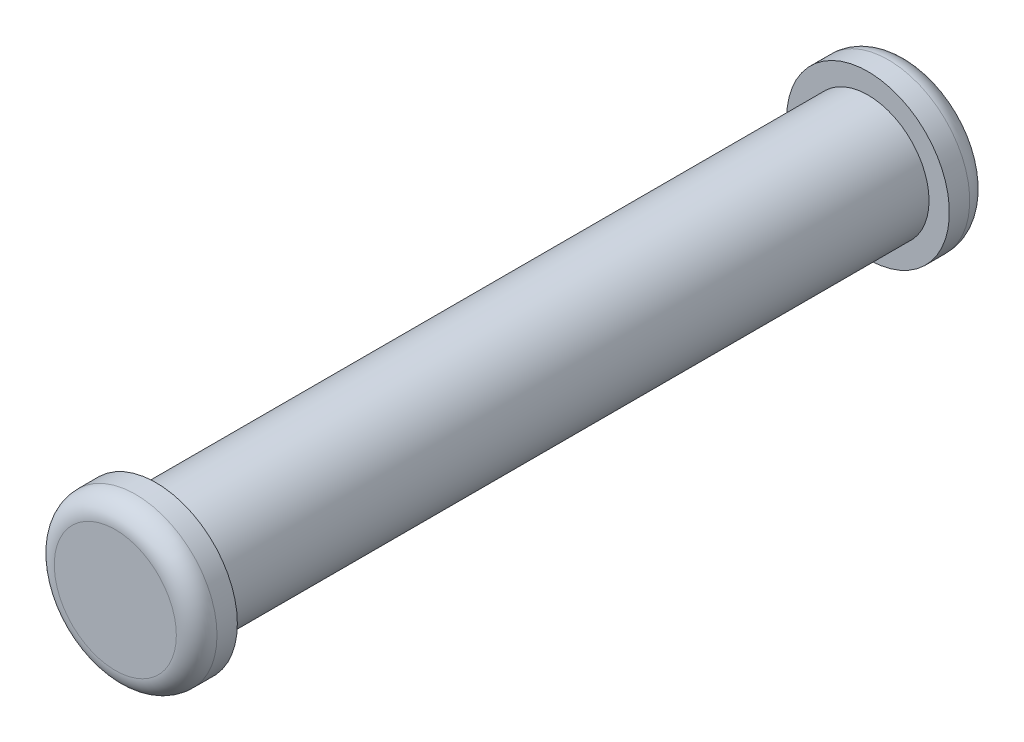
ISO-10303-21;
HEADER;
FILE_DESCRIPTION(('STEP AP214'),'2;1');
FILE_NAME('part.step','',(''),(''),'','','');
FILE_SCHEMA(('AUTOMOTIVE_DESIGN { 1 0 10303 214 1 1 1 1 }'));
ENDSEC;
DATA;
#1=APPLICATION_CONTEXT('core data for automotive mechanical design processes');
#2=APPLICATION_PROTOCOL_DEFINITION('international standard','automotive_design',2000,#1);
#3=PRODUCT_CONTEXT('',#1,'mechanical');
#4=PRODUCT('Part','Part','',(#3));
#5=PRODUCT_RELATED_PRODUCT_CATEGORY('part','',(#4));
#6=PRODUCT_DEFINITION_FORMATION('','',#4);
#7=PRODUCT_DEFINITION_CONTEXT('part definition',#1,'design');
#8=PRODUCT_DEFINITION('design','',#6,#7);
#9=PRODUCT_DEFINITION_SHAPE('','',#8);
#10=(LENGTH_UNIT() NAMED_UNIT(*) SI_UNIT(.MILLI.,.METRE.));
#11=(NAMED_UNIT(*) PLANE_ANGLE_UNIT() SI_UNIT($,.RADIAN.));
#12=(NAMED_UNIT(*) SI_UNIT($,.STERADIAN.) SOLID_ANGLE_UNIT());
#13=UNCERTAINTY_MEASURE_WITH_UNIT(LENGTH_MEASURE(1.E-05),#10,'distance_accuracy_value','');
#14=(GEOMETRIC_REPRESENTATION_CONTEXT(3) GLOBAL_UNCERTAINTY_ASSIGNED_CONTEXT((#13)) GLOBAL_UNIT_ASSIGNED_CONTEXT((#10,
#11,#12)) REPRESENTATION_CONTEXT('',''));
#15=CARTESIAN_POINT('',(0.,0.,0.));
#16=DIRECTION('',(0.,0.,1.));
#17=DIRECTION('',(1.,0.,0.));
#18=AXIS2_PLACEMENT_3D('',#15,#16,#17);
#19=CARTESIAN_POINT('',(0.,0.,17.5));
#20=DIRECTION('',(0.,0.,-1.));
#21=DIRECTION('',(-1.,0.,0.));
#22=AXIS2_PLACEMENT_3D('',#19,#20,#21);
#23=CYLINDRICAL_SURFACE('',#22,1.5);
#24=CARTESIAN_POINT('',(0.,0.,17.5));
#25=DIRECTION('',(0.,0.,1.));
#26=DIRECTION('',(1.,0.,0.));
#27=AXIS2_PLACEMENT_3D('',#24,#25,#26);
#28=CIRCLE('',#27,1.5);
#29=CARTESIAN_POINT('',(1.5,0.,17.5));
#30=VERTEX_POINT('',#29);
#31=EDGE_CURVE('E59',#30,#30,#28,.T.);
#32=ORIENTED_EDGE('',*,*,#31,.F.);
#33=EDGE_LOOP('',(#32));
#34=FACE_BOUND('',#33,.T.);
#35=CARTESIAN_POINT('',(0.,0.,0.));
#36=DIRECTION('',(0.,0.,1.));
#37=DIRECTION('',(1.,0.,0.));
#38=AXIS2_PLACEMENT_3D('',#35,#36,#37);
#39=CIRCLE('',#38,1.5);
#40=CARTESIAN_POINT('',(1.5,0.,0.));
#41=VERTEX_POINT('',#40);
#42=EDGE_CURVE('E60',#41,#41,#39,.T.);
#43=ORIENTED_EDGE('',*,*,#42,.T.);
#44=EDGE_LOOP('',(#43));
#45=FACE_BOUND('',#44,.T.);
#46=ADVANCED_FACE('F39',(#34,#45),#23,.T.);
#47=CARTESIAN_POINT('',(0.,0.,-1.));
#48=DIRECTION('',(0.,0.,1.));
#49=DIRECTION('',(1.,0.,0.));
#50=AXIS2_PLACEMENT_3D('',#47,#48,#49);
#51=CYLINDRICAL_SURFACE('',#50,2.);
#52=CARTESIAN_POINT('',(0.,0.,-0.5));
#53=DIRECTION('',(0.,0.,-1.));
#54=DIRECTION('',(-1.,0.,0.));
#55=AXIS2_PLACEMENT_3D('',#52,#53,#54);
#56=CIRCLE('',#55,2.);
#57=CARTESIAN_POINT('',(-2.,0.,-0.5));
#58=VERTEX_POINT('',#57);
#59=EDGE_CURVE('E50',#58,#58,#56,.F.);
#60=ORIENTED_EDGE('',*,*,#59,.T.);
#61=EDGE_LOOP('',(#60));
#62=FACE_BOUND('',#61,.T.);
#63=CARTESIAN_POINT('',(0.,0.,0.));
#64=DIRECTION('',(0.,0.,-1.));
#65=DIRECTION('',(-1.,0.,0.));
#66=AXIS2_PLACEMENT_3D('',#63,#64,#65);
#67=CIRCLE('',#66,2.);
#68=CARTESIAN_POINT('',(-2.,0.,0.));
#69=VERTEX_POINT('',#68);
#70=EDGE_CURVE('E63',#69,#69,#67,.T.);
#71=ORIENTED_EDGE('',*,*,#70,.T.);
#72=EDGE_LOOP('',(#71));
#73=FACE_BOUND('',#72,.T.);
#74=ADVANCED_FACE('F90',(#62,#73),#51,.T.);
#75=CARTESIAN_POINT('',(0.,0.,-1.));
#76=DIRECTION('',(0.,0.,-1.));
#77=DIRECTION('',(-1.,0.,0.));
#78=AXIS2_PLACEMENT_3D('',#75,#76,#77);
#79=PLANE('',#78);
#80=CARTESIAN_POINT('',(0.,0.,-1.));
#81=DIRECTION('',(0.,0.,-1.));
#82=DIRECTION('',(-1.,0.,0.));
#83=AXIS2_PLACEMENT_3D('',#80,#81,#82);
#84=CIRCLE('',#83,1.5);
#85=CARTESIAN_POINT('',(-1.5,0.,-1.));
#86=VERTEX_POINT('',#85);
#87=EDGE_CURVE('E54',#86,#86,#84,.T.);
#88=ORIENTED_EDGE('',*,*,#87,.T.);
#89=EDGE_LOOP('',(#88));
#90=FACE_BOUND('',#89,.T.);
#91=ADVANCED_FACE('F95',(#90),#79,.T.);
#92=CARTESIAN_POINT('',(0.,0.,0.));
#93=DIRECTION('',(0.,0.,-1.));
#94=DIRECTION('',(-1.,0.,0.));
#95=AXIS2_PLACEMENT_3D('',#92,#93,#94);
#96=PLANE('',#95);
#97=ORIENTED_EDGE('',*,*,#42,.F.);
#98=EDGE_LOOP('',(#97));
#99=FACE_BOUND('',#98,.T.);
#100=ORIENTED_EDGE('',*,*,#70,.F.);
#101=EDGE_LOOP('',(#100));
#102=FACE_BOUND('',#101,.T.);
#103=ADVANCED_FACE('F101',(#99,#102),#96,.F.);
#104=CARTESIAN_POINT('',(0.,0.,18.5));
#105=DIRECTION('',(0.,0.,-1.));
#106=DIRECTION('',(-1.,0.,0.));
#107=AXIS2_PLACEMENT_3D('',#104,#105,#106);
#108=CYLINDRICAL_SURFACE('',#107,2.);
#109=CARTESIAN_POINT('',(0.,0.,18.));
#110=DIRECTION('',(0.,0.,1.));
#111=DIRECTION('',(1.,0.,0.));
#112=AXIS2_PLACEMENT_3D('',#109,#110,#111);
#113=CIRCLE('',#112,2.);
#114=CARTESIAN_POINT('',(2.,0.,18.));
#115=VERTEX_POINT('',#114);
#116=EDGE_CURVE('E10',#115,#115,#113,.F.);
#117=ORIENTED_EDGE('',*,*,#116,.T.);
#118=EDGE_LOOP('',(#117));
#119=FACE_BOUND('',#118,.T.);
#120=CARTESIAN_POINT('',(0.,0.,17.5));
#121=DIRECTION('',(0.,0.,1.));
#122=DIRECTION('',(1.,0.,0.));
#123=AXIS2_PLACEMENT_3D('',#120,#121,#122);
#124=CIRCLE('',#123,2.);
#125=CARTESIAN_POINT('',(2.,0.,17.5));
#126=VERTEX_POINT('',#125);
#127=EDGE_CURVE('E68',#126,#126,#124,.T.);
#128=ORIENTED_EDGE('',*,*,#127,.T.);
#129=EDGE_LOOP('',(#128));
#130=FACE_BOUND('',#129,.T.);
#131=ADVANCED_FACE('F72',(#119,#130),#108,.T.);
#132=CARTESIAN_POINT('',(0.,0.,18.5));
#133=DIRECTION('',(0.,0.,1.));
#134=DIRECTION('',(1.,0.,0.));
#135=AXIS2_PLACEMENT_3D('',#132,#133,#134);
#136=PLANE('',#135);
#137=CARTESIAN_POINT('',(0.,0.,18.5));
#138=DIRECTION('',(0.,0.,1.));
#139=DIRECTION('',(1.,0.,0.));
#140=AXIS2_PLACEMENT_3D('',#137,#138,#139);
#141=CIRCLE('',#140,1.5);
#142=CARTESIAN_POINT('',(1.5,0.,18.5));
#143=VERTEX_POINT('',#142);
#144=EDGE_CURVE('E46',#143,#143,#141,.T.);
#145=ORIENTED_EDGE('',*,*,#144,.T.);
#146=EDGE_LOOP('',(#145));
#147=FACE_BOUND('',#146,.T.);
#148=ADVANCED_FACE('F77',(#147),#136,.T.);
#149=CARTESIAN_POINT('',(0.,0.,17.5));
#150=DIRECTION('',(0.,0.,1.));
#151=DIRECTION('',(1.,0.,0.));
#152=AXIS2_PLACEMENT_3D('',#149,#150,#151);
#153=PLANE('',#152);
#154=ORIENTED_EDGE('',*,*,#31,.T.);
#155=EDGE_LOOP('',(#154));
#156=FACE_BOUND('',#155,.T.);
#157=ORIENTED_EDGE('',*,*,#127,.F.);
#158=EDGE_LOOP('',(#157));
#159=FACE_BOUND('',#158,.T.);
#160=ADVANCED_FACE('F74',(#156,#159),#153,.F.);
#161=CARTESIAN_POINT('',(0.,0.,-0.5));
#162=DIRECTION('',(0.,0.,-1.));
#163=DIRECTION('',(-1.,0.,0.));
#164=AXIS2_PLACEMENT_3D('',#161,#162,#163);
#165=TOROIDAL_SURFACE('',#164,1.5,0.5);
#166=ORIENTED_EDGE('',*,*,#59,.F.);
#167=EDGE_LOOP('',(#166));
#168=FACE_BOUND('',#167,.T.);
#169=ORIENTED_EDGE('',*,*,#87,.F.);
#170=EDGE_LOOP('',(#169));
#171=FACE_BOUND('',#170,.T.);
#172=ADVANCED_FACE('F76',(#168,#171),#165,.T.);
#173=CARTESIAN_POINT('',(0.,0.,18.));
#174=DIRECTION('',(0.,0.,1.));
#175=DIRECTION('',(1.,0.,0.));
#176=AXIS2_PLACEMENT_3D('',#173,#174,#175);
#177=TOROIDAL_SURFACE('',#176,1.5,0.5);
#178=ORIENTED_EDGE('',*,*,#116,.F.);
#179=EDGE_LOOP('',(#178));
#180=FACE_BOUND('',#179,.T.);
#181=ORIENTED_EDGE('',*,*,#144,.F.);
#182=EDGE_LOOP('',(#181));
#183=FACE_BOUND('',#182,.T.);
#184=ADVANCED_FACE('F41',(#180,#183),#177,.T.);
#185=CLOSED_SHELL('',(#46,#74,#91,#103,#131,#148,#160,#172,#184));
#186=MANIFOLD_SOLID_BREP('B2',#185);
#187=ADVANCED_BREP_SHAPE_REPRESENTATION('',(#18,#186),#14);
#188=SHAPE_DEFINITION_REPRESENTATION(#9,#187);
ENDSEC;
END-ISO-10303-21;
